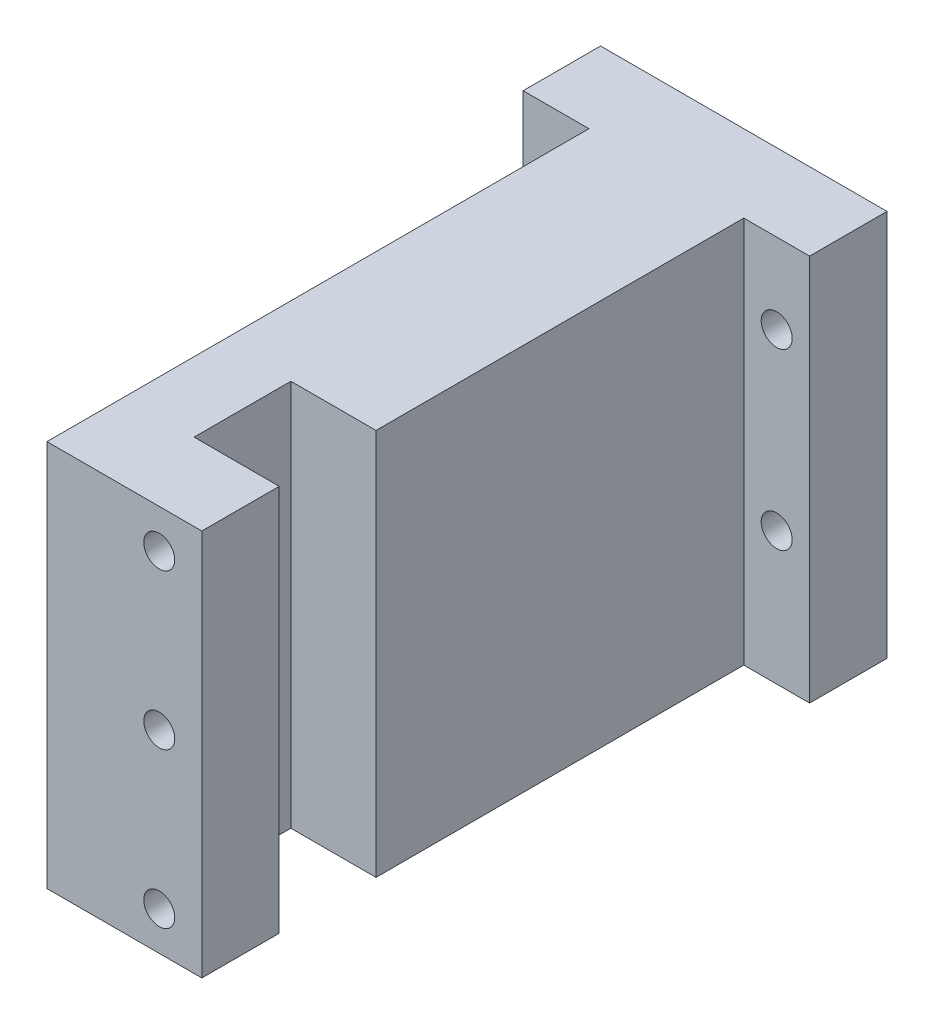
ISO-10303-21;
HEADER;
FILE_DESCRIPTION(('STEP AP214'),'2;1');
FILE_NAME('part.step','',(''),(''),'','','');
FILE_SCHEMA(('AUTOMOTIVE_DESIGN { 1 0 10303 214 1 1 1 1 }'));
ENDSEC;
DATA;
#1=APPLICATION_CONTEXT('core data for automotive mechanical design processes');
#2=APPLICATION_PROTOCOL_DEFINITION('international standard','automotive_design',2000,#1);
#3=PRODUCT_CONTEXT('',#1,'mechanical');
#4=PRODUCT('Part','Part','',(#3));
#5=PRODUCT_RELATED_PRODUCT_CATEGORY('part','',(#4));
#6=PRODUCT_DEFINITION_FORMATION('','',#4);
#7=PRODUCT_DEFINITION_CONTEXT('part definition',#1,'design');
#8=PRODUCT_DEFINITION('design','',#6,#7);
#9=PRODUCT_DEFINITION_SHAPE('','',#8);
#10=(LENGTH_UNIT() NAMED_UNIT(*) SI_UNIT(.MILLI.,.METRE.));
#11=(NAMED_UNIT(*) PLANE_ANGLE_UNIT() SI_UNIT($,.RADIAN.));
#12=(NAMED_UNIT(*) SI_UNIT($,.STERADIAN.) SOLID_ANGLE_UNIT());
#13=UNCERTAINTY_MEASURE_WITH_UNIT(LENGTH_MEASURE(1.E-05),#10,'distance_accuracy_value','');
#14=(GEOMETRIC_REPRESENTATION_CONTEXT(3) GLOBAL_UNCERTAINTY_ASSIGNED_CONTEXT((#13)) GLOBAL_UNIT_ASSIGNED_CONTEXT((#10,
#11,#12)) REPRESENTATION_CONTEXT('',''));
#15=CARTESIAN_POINT('',(0.,0.,0.));
#16=DIRECTION('',(0.,0.,1.));
#17=DIRECTION('',(1.,0.,0.));
#18=AXIS2_PLACEMENT_3D('',#15,#16,#17);
#19=CARTESIAN_POINT('',(20.,0.,160.));
#20=DIRECTION('',(-1.,0.,0.));
#21=DIRECTION('',(0.,-1.,0.));
#22=AXIS2_PLACEMENT_3D('',#19,#20,#21);
#23=PLANE('',#22);
#24=DIRECTION('',(0.,0.,-1.));
#25=VECTOR('',#24,1.);
#26=CARTESIAN_POINT('',(20.,50.,160.));
#27=LINE('',#26,#25);
#28=CARTESIAN_POINT('',(20.,50.,115.));
#29=VERTEX_POINT('',#28);
#30=CARTESIAN_POINT('',(20.,50.,20.));
#31=VERTEX_POINT('',#30);
#32=EDGE_CURVE('E206',#29,#31,#27,.T.);
#33=ORIENTED_EDGE('',*,*,#32,.F.);
#34=DIRECTION('',(0.,1.,0.));
#35=VECTOR('',#34,1.);
#36=CARTESIAN_POINT('',(20.,-50.,115.));
#37=LINE('',#36,#35);
#38=CARTESIAN_POINT('',(20.,-50.,115.));
#39=VERTEX_POINT('',#38);
#40=EDGE_CURVE('E160',#39,#29,#37,.T.);
#41=ORIENTED_EDGE('',*,*,#40,.F.);
#42=DIRECTION('',(0.,0.,-1.));
#43=VECTOR('',#42,1.);
#44=CARTESIAN_POINT('',(20.,-50.,160.));
#45=LINE('',#44,#43);
#46=CARTESIAN_POINT('',(20.,-50.,20.));
#47=VERTEX_POINT('',#46);
#48=EDGE_CURVE('E58',#39,#47,#45,.T.);
#49=ORIENTED_EDGE('',*,*,#48,.T.);
#50=DIRECTION('',(0.,1.,0.));
#51=VECTOR('',#50,1.);
#52=CARTESIAN_POINT('',(20.,0.,20.));
#53=LINE('',#52,#51);
#54=EDGE_CURVE('E184',#47,#31,#53,.T.);
#55=ORIENTED_EDGE('',*,*,#54,.T.);
#56=EDGE_LOOP('',(#33,#41,#49,#55));
#57=FACE_BOUND('',#56,.T.);
#58=ADVANCED_FACE('F35',(#57),#23,.F.);
#59=CARTESIAN_POINT('',(0.,0.,20.));
#60=DIRECTION('',(0.,0.,1.));
#61=DIRECTION('',(1.,0.,0.));
#62=AXIS2_PLACEMENT_3D('',#59,#60,#61);
#63=PLANE('',#62);
#64=CARTESIAN_POINT('',(-28.5,-15.7,20.));
#65=DIRECTION('',(0.,0.,1.));
#66=DIRECTION('',(1.,0.,0.));
#67=AXIS2_PLACEMENT_3D('',#64,#65,#66);
#68=CIRCLE('',#67,4.);
#69=CARTESIAN_POINT('',(-24.5,-15.7,20.));
#70=VERTEX_POINT('',#69);
#71=EDGE_CURVE('E173',#70,#70,#68,.T.);
#72=ORIENTED_EDGE('',*,*,#71,.F.);
#73=EDGE_LOOP('',(#72));
#74=FACE_BOUND('',#73,.T.);
#75=CARTESIAN_POINT('',(-28.5,29.3,20.));
#76=DIRECTION('',(0.,0.,1.));
#77=DIRECTION('',(1.,0.,0.));
#78=AXIS2_PLACEMENT_3D('',#75,#76,#77);
#79=CIRCLE('',#78,4.);
#80=CARTESIAN_POINT('',(-24.5,29.3,20.));
#81=VERTEX_POINT('',#80);
#82=EDGE_CURVE('E166',#81,#81,#79,.T.);
#83=ORIENTED_EDGE('',*,*,#82,.F.);
#84=EDGE_LOOP('',(#83));
#85=FACE_BOUND('',#84,.T.);
#86=DIRECTION('',(0.,-1.,0.));
#87=VECTOR('',#86,1.);
#88=CARTESIAN_POINT('',(-20.,0.,20.));
#89=LINE('',#88,#87);
#90=CARTESIAN_POINT('',(-20.,50.,20.));
#91=VERTEX_POINT('',#90);
#92=CARTESIAN_POINT('',(-20.,-50.,20.));
#93=VERTEX_POINT('',#92);
#94=EDGE_CURVE('E191',#91,#93,#89,.T.);
#95=ORIENTED_EDGE('',*,*,#94,.F.);
#96=DIRECTION('',(-1.,0.,0.));
#97=VECTOR('',#96,1.);
#98=CARTESIAN_POINT('',(-37.,50.,20.));
#99=LINE('',#98,#97);
#100=CARTESIAN_POINT('',(-37.,50.,20.));
#101=VERTEX_POINT('',#100);
#102=EDGE_CURVE('E216',#91,#101,#99,.T.);
#103=ORIENTED_EDGE('',*,*,#102,.T.);
#104=DIRECTION('',(0.,-1.,0.));
#105=VECTOR('',#104,1.);
#106=CARTESIAN_POINT('',(-37.,50.,20.));
#107=LINE('',#106,#105);
#108=CARTESIAN_POINT('',(-37.,-50.,20.));
#109=VERTEX_POINT('',#108);
#110=EDGE_CURVE('E221',#101,#109,#107,.T.);
#111=ORIENTED_EDGE('',*,*,#110,.T.);
#112=DIRECTION('',(1.,0.,0.));
#113=VECTOR('',#112,1.);
#114=CARTESIAN_POINT('',(-37.,-50.,20.));
#115=LINE('',#114,#113);
#116=EDGE_CURVE('E224',#109,#93,#115,.T.);
#117=ORIENTED_EDGE('',*,*,#116,.T.);
#118=EDGE_LOOP('',(#95,#103,#111,#117));
#119=FACE_BOUND('',#118,.T.);
#120=ADVANCED_FACE('F276',(#74,#85,#119),#63,.T.);
#121=CARTESIAN_POINT('',(37.,50.,20.));
#122=DIRECTION('',(-1.,0.,0.));
#123=DIRECTION('',(0.,-1.,0.));
#124=AXIS2_PLACEMENT_3D('',#121,#122,#123);
#125=PLANE('',#124);
#126=DIRECTION('',(0.,1.,0.));
#127=VECTOR('',#126,1.);
#128=CARTESIAN_POINT('',(37.,50.,0.));
#129=LINE('',#128,#127);
#130=CARTESIAN_POINT('',(37.,-50.,0.));
#131=VERTEX_POINT('',#130);
#132=CARTESIAN_POINT('',(37.,50.,0.));
#133=VERTEX_POINT('',#132);
#134=EDGE_CURVE('E212',#131,#133,#129,.T.);
#135=ORIENTED_EDGE('',*,*,#134,.T.);
#136=DIRECTION('',(0.,0.,-1.));
#137=VECTOR('',#136,1.);
#138=CARTESIAN_POINT('',(37.,50.,20.));
#139=LINE('',#138,#137);
#140=CARTESIAN_POINT('',(37.,50.,20.));
#141=VERTEX_POINT('',#140);
#142=EDGE_CURVE('E11',#141,#133,#139,.T.);
#143=ORIENTED_EDGE('',*,*,#142,.F.);
#144=DIRECTION('',(0.,1.,0.));
#145=VECTOR('',#144,1.);
#146=CARTESIAN_POINT('',(37.,50.,20.));
#147=LINE('',#146,#145);
#148=CARTESIAN_POINT('',(37.,-50.,20.));
#149=VERTEX_POINT('',#148);
#150=EDGE_CURVE('E213',#149,#141,#147,.T.);
#151=ORIENTED_EDGE('',*,*,#150,.F.);
#152=DIRECTION('',(0.,0.,-1.));
#153=VECTOR('',#152,1.);
#154=CARTESIAN_POINT('',(37.,-50.,20.));
#155=LINE('',#154,#153);
#156=EDGE_CURVE('E226',#149,#131,#155,.T.);
#157=ORIENTED_EDGE('',*,*,#156,.T.);
#158=EDGE_LOOP('',(#135,#143,#151,#157));
#159=FACE_BOUND('',#158,.T.);
#160=ADVANCED_FACE('F37',(#159),#125,.F.);
#161=CARTESIAN_POINT('',(-37.,50.,20.));
#162=DIRECTION('',(0.,-1.,0.));
#163=DIRECTION('',(0.,0.,-1.));
#164=AXIS2_PLACEMENT_3D('',#161,#162,#163);
#165=PLANE('',#164);
#166=DIRECTION('',(0.,0.,1.));
#167=VECTOR('',#166,1.);
#168=CARTESIAN_POINT('',(-1.99999999999998,50.,140.));
#169=LINE('',#168,#167);
#170=CARTESIAN_POINT('',(-1.99999999999998,50.,115.));
#171=VERTEX_POINT('',#170);
#172=CARTESIAN_POINT('',(-1.99999999999998,50.,140.));
#173=VERTEX_POINT('',#172);
#174=EDGE_CURVE('E133',#171,#173,#169,.T.);
#175=ORIENTED_EDGE('',*,*,#174,.F.);
#176=DIRECTION('',(-1.,0.,0.));
#177=VECTOR('',#176,1.);
#178=CARTESIAN_POINT('',(-1.99999999999998,50.,115.));
#179=LINE('',#178,#177);
#180=EDGE_CURVE('E145',#29,#171,#179,.T.);
#181=ORIENTED_EDGE('',*,*,#180,.F.);
#182=ORIENTED_EDGE('',*,*,#32,.T.);
#183=EDGE_CURVE('E218',#141,#31,#99,.T.);
#184=ORIENTED_EDGE('',*,*,#183,.F.);
#185=ORIENTED_EDGE('',*,*,#142,.T.);
#186=DIRECTION('',(-1.,0.,0.));
#187=VECTOR('',#186,1.);
#188=CARTESIAN_POINT('',(-37.,50.,0.));
#189=LINE('',#188,#187);
#190=CARTESIAN_POINT('',(-37.,50.,0.));
#191=VERTEX_POINT('',#190);
#192=EDGE_CURVE('E229',#133,#191,#189,.T.);
#193=ORIENTED_EDGE('',*,*,#192,.T.);
#194=DIRECTION('',(0.,0.,-1.));
#195=VECTOR('',#194,1.);
#196=CARTESIAN_POINT('',(-37.,50.,20.));
#197=LINE('',#196,#195);
#198=EDGE_CURVE('E43',#101,#191,#197,.T.);
#199=ORIENTED_EDGE('',*,*,#198,.F.);
#200=ORIENTED_EDGE('',*,*,#102,.F.);
#201=DIRECTION('',(0.,0.,-1.));
#202=VECTOR('',#201,1.);
#203=CARTESIAN_POINT('',(-20.,50.,160.));
#204=LINE('',#203,#202);
#205=CARTESIAN_POINT('',(-20.,50.,160.));
#206=VERTEX_POINT('',#205);
#207=EDGE_CURVE('E203',#206,#91,#204,.T.);
#208=ORIENTED_EDGE('',*,*,#207,.F.);
#209=DIRECTION('',(-1.,0.,0.));
#210=VECTOR('',#209,1.);
#211=CARTESIAN_POINT('',(0.,50.,160.));
#212=LINE('',#211,#210);
#213=CARTESIAN_POINT('',(20.,50.,160.));
#214=VERTEX_POINT('',#213);
#215=EDGE_CURVE('E193',#214,#206,#212,.T.);
#216=ORIENTED_EDGE('',*,*,#215,.F.);
#217=CARTESIAN_POINT('',(20.,50.,140.));
#218=VERTEX_POINT('',#217);
#219=EDGE_CURVE('E207',#214,#218,#27,.T.);
#220=ORIENTED_EDGE('',*,*,#219,.T.);
#221=DIRECTION('',(1.,0.,0.));
#222=VECTOR('',#221,1.);
#223=CARTESIAN_POINT('',(-1.99999999999998,50.,140.));
#224=LINE('',#223,#222);
#225=EDGE_CURVE('E50',#173,#218,#224,.T.);
#226=ORIENTED_EDGE('',*,*,#225,.F.);
#227=EDGE_LOOP('',(#175,#181,#182,#184,#185,#193,#199,#200,#208,#216,#220,#226));
#228=FACE_BOUND('',#227,.T.);
#229=ADVANCED_FACE('F261',(#228),#165,.F.);
#230=CARTESIAN_POINT('',(-37.,50.,20.));
#231=DIRECTION('',(1.,0.,0.));
#232=DIRECTION('',(0.,1.,0.));
#233=AXIS2_PLACEMENT_3D('',#230,#231,#232);
#234=PLANE('',#233);
#235=DIRECTION('',(0.,-1.,0.));
#236=VECTOR('',#235,1.);
#237=CARTESIAN_POINT('',(-37.,50.,0.));
#238=LINE('',#237,#236);
#239=CARTESIAN_POINT('',(-37.,-50.,0.));
#240=VERTEX_POINT('',#239);
#241=EDGE_CURVE('E231',#191,#240,#238,.T.);
#242=ORIENTED_EDGE('',*,*,#241,.T.);
#243=DIRECTION('',(0.,0.,-1.));
#244=VECTOR('',#243,1.);
#245=CARTESIAN_POINT('',(-37.,-50.,20.));
#246=LINE('',#245,#244);
#247=EDGE_CURVE('E236',#109,#240,#246,.T.);
#248=ORIENTED_EDGE('',*,*,#247,.F.);
#249=ORIENTED_EDGE('',*,*,#110,.F.);
#250=ORIENTED_EDGE('',*,*,#198,.T.);
#251=EDGE_LOOP('',(#242,#248,#249,#250));
#252=FACE_BOUND('',#251,.T.);
#253=ADVANCED_FACE('F243',(#252),#234,.F.);
#254=CARTESIAN_POINT('',(-37.,-50.,20.));
#255=DIRECTION('',(0.,1.,0.));
#256=DIRECTION('',(-1.,0.,0.));
#257=AXIS2_PLACEMENT_3D('',#254,#255,#256);
#258=PLANE('',#257);
#259=ORIENTED_EDGE('',*,*,#48,.F.);
#260=DIRECTION('',(-1.,0.,0.));
#261=VECTOR('',#260,1.);
#262=CARTESIAN_POINT('',(-1.99999999999998,-50.,115.));
#263=LINE('',#262,#261);
#264=CARTESIAN_POINT('',(-1.99999999999998,-50.,115.));
#265=VERTEX_POINT('',#264);
#266=EDGE_CURVE('E135',#39,#265,#263,.T.);
#267=ORIENTED_EDGE('',*,*,#266,.T.);
#268=DIRECTION('',(0.,0.,1.));
#269=VECTOR('',#268,1.);
#270=CARTESIAN_POINT('',(-1.99999999999998,-50.,140.));
#271=LINE('',#270,#269);
#272=CARTESIAN_POINT('',(-1.99999999999998,-50.,140.));
#273=VERTEX_POINT('',#272);
#274=EDGE_CURVE('E130',#265,#273,#271,.T.);
#275=ORIENTED_EDGE('',*,*,#274,.T.);
#276=DIRECTION('',(1.,0.,0.));
#277=VECTOR('',#276,1.);
#278=CARTESIAN_POINT('',(-1.99999999999998,-50.,140.));
#279=LINE('',#278,#277);
#280=CARTESIAN_POINT('',(20.,-50.,140.));
#281=VERTEX_POINT('',#280);
#282=EDGE_CURVE('E138',#273,#281,#279,.T.);
#283=ORIENTED_EDGE('',*,*,#282,.T.);
#284=CARTESIAN_POINT('',(20.,-50.,160.));
#285=VERTEX_POINT('',#284);
#286=EDGE_CURVE('E210',#285,#281,#45,.T.);
#287=ORIENTED_EDGE('',*,*,#286,.F.);
#288=DIRECTION('',(1.,0.,0.));
#289=VECTOR('',#288,1.);
#290=CARTESIAN_POINT('',(0.,-50.,160.));
#291=LINE('',#290,#289);
#292=CARTESIAN_POINT('',(-20.,-50.,160.));
#293=VERTEX_POINT('',#292);
#294=EDGE_CURVE('E187',#293,#285,#291,.T.);
#295=ORIENTED_EDGE('',*,*,#294,.F.);
#296=DIRECTION('',(0.,0.,-1.));
#297=VECTOR('',#296,1.);
#298=CARTESIAN_POINT('',(-20.,-50.,160.));
#299=LINE('',#298,#297);
#300=EDGE_CURVE('E197',#293,#93,#299,.T.);
#301=ORIENTED_EDGE('',*,*,#300,.T.);
#302=ORIENTED_EDGE('',*,*,#116,.F.);
#303=ORIENTED_EDGE('',*,*,#247,.T.);
#304=DIRECTION('',(1.,0.,0.));
#305=VECTOR('',#304,1.);
#306=CARTESIAN_POINT('',(-37.,-50.,0.));
#307=LINE('',#306,#305);
#308=EDGE_CURVE('E217',#240,#131,#307,.T.);
#309=ORIENTED_EDGE('',*,*,#308,.T.);
#310=ORIENTED_EDGE('',*,*,#156,.F.);
#311=EDGE_CURVE('E223',#47,#149,#115,.T.);
#312=ORIENTED_EDGE('',*,*,#311,.F.);
#313=EDGE_LOOP('',(#259,#267,#275,#283,#287,#295,#301,#302,#303,#309,#310,#312));
#314=FACE_BOUND('',#313,.T.);
#315=ADVANCED_FACE('F144',(#314),#258,.F.);
#316=CARTESIAN_POINT('',(28.5,29.3,20.));
#317=DIRECTION('',(0.,0.,1.));
#318=DIRECTION('',(1.,0.,0.));
#319=AXIS2_PLACEMENT_3D('',#316,#317,#318);
#320=CIRCLE('',#319,4.);
#321=CARTESIAN_POINT('',(32.5,29.3,20.));
#322=VERTEX_POINT('',#321);
#323=EDGE_CURVE('E167',#322,#322,#320,.T.);
#324=ORIENTED_EDGE('',*,*,#323,.F.);
#325=EDGE_LOOP('',(#324));
#326=FACE_BOUND('',#325,.T.);
#327=CARTESIAN_POINT('',(28.5,-15.7,20.));
#328=DIRECTION('',(0.,0.,1.));
#329=DIRECTION('',(1.,0.,0.));
#330=AXIS2_PLACEMENT_3D('',#327,#328,#329);
#331=CIRCLE('',#330,4.);
#332=CARTESIAN_POINT('',(32.5,-15.7,20.));
#333=VERTEX_POINT('',#332);
#334=EDGE_CURVE('E159',#333,#333,#331,.T.);
#335=ORIENTED_EDGE('',*,*,#334,.F.);
#336=EDGE_LOOP('',(#335));
#337=FACE_BOUND('',#336,.T.);
#338=ORIENTED_EDGE('',*,*,#54,.F.);
#339=ORIENTED_EDGE('',*,*,#311,.T.);
#340=ORIENTED_EDGE('',*,*,#150,.T.);
#341=ORIENTED_EDGE('',*,*,#183,.T.);
#342=EDGE_LOOP('',(#338,#339,#340,#341));
#343=FACE_BOUND('',#342,.T.);
#344=ADVANCED_FACE('F258',(#326,#337,#343),#63,.T.);
#345=CARTESIAN_POINT('',(0.,0.,0.));
#346=DIRECTION('',(0.,0.,1.));
#347=DIRECTION('',(1.,0.,0.));
#348=AXIS2_PLACEMENT_3D('',#345,#346,#347);
#349=PLANE('',#348);
#350=CARTESIAN_POINT('',(28.5,29.3,0.));
#351=DIRECTION('',(0.,0.,1.));
#352=DIRECTION('',(1.,0.,0.));
#353=AXIS2_PLACEMENT_3D('',#350,#351,#352);
#354=CIRCLE('',#353,4.);
#355=CARTESIAN_POINT('',(32.5,29.3,0.));
#356=VERTEX_POINT('',#355);
#357=EDGE_CURVE('E163',#356,#356,#354,.T.);
#358=ORIENTED_EDGE('',*,*,#357,.T.);
#359=EDGE_LOOP('',(#358));
#360=FACE_BOUND('',#359,.T.);
#361=CARTESIAN_POINT('',(-28.5,-15.7,0.));
#362=DIRECTION('',(0.,0.,1.));
#363=DIRECTION('',(1.,0.,0.));
#364=AXIS2_PLACEMENT_3D('',#361,#362,#363);
#365=CIRCLE('',#364,4.);
#366=CARTESIAN_POINT('',(-24.5,-15.7,0.));
#367=VERTEX_POINT('',#366);
#368=EDGE_CURVE('E170',#367,#367,#365,.T.);
#369=ORIENTED_EDGE('',*,*,#368,.T.);
#370=EDGE_LOOP('',(#369));
#371=FACE_BOUND('',#370,.T.);
#372=CARTESIAN_POINT('',(28.5,-15.7,0.));
#373=DIRECTION('',(0.,0.,1.));
#374=DIRECTION('',(1.,0.,0.));
#375=AXIS2_PLACEMENT_3D('',#372,#373,#374);
#376=CIRCLE('',#375,4.);
#377=CARTESIAN_POINT('',(32.5,-15.7,0.));
#378=VERTEX_POINT('',#377);
#379=EDGE_CURVE('E176',#378,#378,#376,.T.);
#380=ORIENTED_EDGE('',*,*,#379,.T.);
#381=EDGE_LOOP('',(#380));
#382=FACE_BOUND('',#381,.T.);
#383=CARTESIAN_POINT('',(-28.5,29.3,0.));
#384=DIRECTION('',(0.,0.,1.));
#385=DIRECTION('',(1.,0.,0.));
#386=AXIS2_PLACEMENT_3D('',#383,#384,#385);
#387=CIRCLE('',#386,4.);
#388=CARTESIAN_POINT('',(-24.5,29.3,0.));
#389=VERTEX_POINT('',#388);
#390=EDGE_CURVE('E181',#389,#389,#387,.T.);
#391=ORIENTED_EDGE('',*,*,#390,.T.);
#392=EDGE_LOOP('',(#391));
#393=FACE_BOUND('',#392,.T.);
#394=ORIENTED_EDGE('',*,*,#134,.F.);
#395=ORIENTED_EDGE('',*,*,#308,.F.);
#396=ORIENTED_EDGE('',*,*,#241,.F.);
#397=ORIENTED_EDGE('',*,*,#192,.F.);
#398=EDGE_LOOP('',(#394,#395,#396,#397));
#399=FACE_BOUND('',#398,.T.);
#400=ADVANCED_FACE('F250',(#360,#371,#382,#393,#399),#349,.F.);
#401=ORIENTED_EDGE('',*,*,#286,.T.);
#402=DIRECTION('',(0.,1.,0.));
#403=VECTOR('',#402,1.);
#404=CARTESIAN_POINT('',(20.,-50.,140.));
#405=LINE('',#404,#403);
#406=EDGE_CURVE('E134',#281,#218,#405,.T.);
#407=ORIENTED_EDGE('',*,*,#406,.T.);
#408=ORIENTED_EDGE('',*,*,#219,.F.);
#409=DIRECTION('',(0.,1.,0.));
#410=VECTOR('',#409,1.);
#411=CARTESIAN_POINT('',(20.,0.,160.));
#412=LINE('',#411,#410);
#413=EDGE_CURVE('E190',#285,#214,#412,.T.);
#414=ORIENTED_EDGE('',*,*,#413,.F.);
#415=EDGE_LOOP('',(#401,#407,#408,#414));
#416=FACE_BOUND('',#415,.T.);
#417=ADVANCED_FACE('F278',(#416),#23,.F.);
#418=CARTESIAN_POINT('',(-20.,0.,160.));
#419=DIRECTION('',(1.,0.,0.));
#420=DIRECTION('',(0.,0.,-1.));
#421=AXIS2_PLACEMENT_3D('',#418,#419,#420);
#422=PLANE('',#421);
#423=ORIENTED_EDGE('',*,*,#94,.T.);
#424=ORIENTED_EDGE('',*,*,#300,.F.);
#425=DIRECTION('',(0.,-1.,0.));
#426=VECTOR('',#425,1.);
#427=CARTESIAN_POINT('',(-20.,0.,160.));
#428=LINE('',#427,#426);
#429=EDGE_CURVE('E195',#206,#293,#428,.T.);
#430=ORIENTED_EDGE('',*,*,#429,.F.);
#431=ORIENTED_EDGE('',*,*,#207,.T.);
#432=EDGE_LOOP('',(#423,#424,#430,#431));
#433=FACE_BOUND('',#432,.T.);
#434=ADVANCED_FACE('F286',(#433),#422,.F.);
#435=CARTESIAN_POINT('',(0.,0.,160.));
#436=DIRECTION('',(0.,0.,1.));
#437=DIRECTION('',(1.,0.,0.));
#438=AXIS2_PLACEMENT_3D('',#435,#436,#437);
#439=PLANE('',#438);
#440=CARTESIAN_POINT('',(9.00000000000002,40.,160.));
#441=DIRECTION('',(0.,0.,1.));
#442=DIRECTION('',(1.,0.,0.));
#443=AXIS2_PLACEMENT_3D('',#440,#441,#442);
#444=CIRCLE('',#443,4.);
#445=CARTESIAN_POINT('',(13.,40.,160.));
#446=VERTEX_POINT('',#445);
#447=EDGE_CURVE('E492',#446,#446,#444,.T.);
#448=ORIENTED_EDGE('',*,*,#447,.F.);
#449=EDGE_LOOP('',(#448));
#450=FACE_BOUND('',#449,.T.);
#451=CARTESIAN_POINT('',(9.00000000000002,0.,160.));
#452=DIRECTION('',(0.,0.,1.));
#453=DIRECTION('',(1.,0.,0.));
#454=AXIS2_PLACEMENT_3D('',#451,#452,#453);
#455=CIRCLE('',#454,4.00000000000001);
#456=CARTESIAN_POINT('',(13.,0.,160.));
#457=VERTEX_POINT('',#456);
#458=EDGE_CURVE('E500',#457,#457,#455,.T.);
#459=ORIENTED_EDGE('',*,*,#458,.F.);
#460=EDGE_LOOP('',(#459));
#461=FACE_BOUND('',#460,.T.);
#462=CARTESIAN_POINT('',(9.00000000000002,-40.,160.));
#463=DIRECTION('',(0.,0.,1.));
#464=DIRECTION('',(1.,0.,0.));
#465=AXIS2_PLACEMENT_3D('',#462,#463,#464);
#466=CIRCLE('',#465,4.);
#467=CARTESIAN_POINT('',(13.,-40.,160.));
#468=VERTEX_POINT('',#467);
#469=EDGE_CURVE('E150',#468,#468,#466,.T.);
#470=ORIENTED_EDGE('',*,*,#469,.F.);
#471=EDGE_LOOP('',(#470));
#472=FACE_BOUND('',#471,.T.);
#473=ORIENTED_EDGE('',*,*,#294,.T.);
#474=ORIENTED_EDGE('',*,*,#413,.T.);
#475=ORIENTED_EDGE('',*,*,#215,.T.);
#476=ORIENTED_EDGE('',*,*,#429,.T.);
#477=EDGE_LOOP('',(#473,#474,#475,#476));
#478=FACE_BOUND('',#477,.T.);
#479=ADVANCED_FACE('F292',(#450,#461,#472,#478),#439,.T.);
#480=CARTESIAN_POINT('',(-28.5,29.3,0.));
#481=DIRECTION('',(0.,0.,1.));
#482=DIRECTION('',(1.,0.,0.));
#483=AXIS2_PLACEMENT_3D('',#480,#481,#482);
#484=CYLINDRICAL_SURFACE('',#483,4.);
#485=ORIENTED_EDGE('',*,*,#390,.F.);
#486=EDGE_LOOP('',(#485));
#487=FACE_BOUND('',#486,.T.);
#488=ORIENTED_EDGE('',*,*,#82,.T.);
#489=EDGE_LOOP('',(#488));
#490=FACE_BOUND('',#489,.T.);
#491=ADVANCED_FACE('F305',(#487,#490),#484,.F.);
#492=CARTESIAN_POINT('',(28.5,-15.7,0.));
#493=DIRECTION('',(0.,0.,1.));
#494=DIRECTION('',(1.,0.,0.));
#495=AXIS2_PLACEMENT_3D('',#492,#493,#494);
#496=CYLINDRICAL_SURFACE('',#495,4.);
#497=ORIENTED_EDGE('',*,*,#379,.F.);
#498=EDGE_LOOP('',(#497));
#499=FACE_BOUND('',#498,.T.);
#500=ORIENTED_EDGE('',*,*,#334,.T.);
#501=EDGE_LOOP('',(#500));
#502=FACE_BOUND('',#501,.T.);
#503=ADVANCED_FACE('F311',(#499,#502),#496,.F.);
#504=CARTESIAN_POINT('',(-28.5,-15.7,0.));
#505=DIRECTION('',(0.,0.,1.));
#506=DIRECTION('',(1.,0.,0.));
#507=AXIS2_PLACEMENT_3D('',#504,#505,#506);
#508=CYLINDRICAL_SURFACE('',#507,4.);
#509=ORIENTED_EDGE('',*,*,#368,.F.);
#510=EDGE_LOOP('',(#509));
#511=FACE_BOUND('',#510,.T.);
#512=ORIENTED_EDGE('',*,*,#71,.T.);
#513=EDGE_LOOP('',(#512));
#514=FACE_BOUND('',#513,.T.);
#515=ADVANCED_FACE('F319',(#511,#514),#508,.F.);
#516=CARTESIAN_POINT('',(28.5,29.3,0.));
#517=DIRECTION('',(0.,0.,1.));
#518=DIRECTION('',(1.,0.,0.));
#519=AXIS2_PLACEMENT_3D('',#516,#517,#518);
#520=CYLINDRICAL_SURFACE('',#519,4.);
#521=ORIENTED_EDGE('',*,*,#357,.F.);
#522=EDGE_LOOP('',(#521));
#523=FACE_BOUND('',#522,.T.);
#524=ORIENTED_EDGE('',*,*,#323,.T.);
#525=EDGE_LOOP('',(#524));
#526=FACE_BOUND('',#525,.T.);
#527=ADVANCED_FACE('F272',(#523,#526),#520,.F.);
#528=CARTESIAN_POINT('',(-1.99999999999998,-50.,140.));
#529=DIRECTION('',(-1.,0.,0.));
#530=DIRECTION('',(0.,0.,1.));
#531=AXIS2_PLACEMENT_3D('',#528,#529,#530);
#532=PLANE('',#531);
#533=ORIENTED_EDGE('',*,*,#174,.T.);
#534=DIRECTION('',(0.,1.,0.));
#535=VECTOR('',#534,1.);
#536=CARTESIAN_POINT('',(-1.99999999999998,-50.,140.));
#537=LINE('',#536,#535);
#538=EDGE_CURVE('E126',#273,#173,#537,.T.);
#539=ORIENTED_EDGE('',*,*,#538,.F.);
#540=ORIENTED_EDGE('',*,*,#274,.F.);
#541=DIRECTION('',(0.,1.,0.));
#542=VECTOR('',#541,1.);
#543=CARTESIAN_POINT('',(-1.99999999999998,-50.,115.));
#544=LINE('',#543,#542);
#545=EDGE_CURVE('E157',#265,#171,#544,.T.);
#546=ORIENTED_EDGE('',*,*,#545,.T.);
#547=EDGE_LOOP('',(#533,#539,#540,#546));
#548=FACE_BOUND('',#547,.T.);
#549=ADVANCED_FACE('F128',(#548),#532,.F.);
#550=CARTESIAN_POINT('',(-1.99999999999998,-50.,115.));
#551=DIRECTION('',(0.,0.,-1.));
#552=DIRECTION('',(-1.,0.,0.));
#553=AXIS2_PLACEMENT_3D('',#550,#551,#552);
#554=PLANE('',#553);
#555=ORIENTED_EDGE('',*,*,#180,.T.);
#556=ORIENTED_EDGE('',*,*,#545,.F.);
#557=ORIENTED_EDGE('',*,*,#266,.F.);
#558=ORIENTED_EDGE('',*,*,#40,.T.);
#559=EDGE_LOOP('',(#555,#556,#557,#558));
#560=FACE_BOUND('',#559,.T.);
#561=ADVANCED_FACE('F263',(#560),#554,.F.);
#562=CARTESIAN_POINT('',(-1.99999999999998,-50.,140.));
#563=DIRECTION('',(0.,0.,1.));
#564=DIRECTION('',(1.,0.,0.));
#565=AXIS2_PLACEMENT_3D('',#562,#563,#564);
#566=PLANE('',#565);
#567=ORIENTED_EDGE('',*,*,#225,.T.);
#568=ORIENTED_EDGE('',*,*,#406,.F.);
#569=ORIENTED_EDGE('',*,*,#282,.F.);
#570=ORIENTED_EDGE('',*,*,#538,.T.);
#571=EDGE_LOOP('',(#567,#568,#569,#570));
#572=FACE_BOUND('',#571,.T.);
#573=ADVANCED_FACE('F139',(#572),#566,.F.);
#574=CARTESIAN_POINT('',(9.00000000000002,-40.,150.));
#575=DIRECTION('',(0.,0.,1.));
#576=DIRECTION('',(1.,0.,0.));
#577=AXIS2_PLACEMENT_3D('',#574,#575,#576);
#578=CYLINDRICAL_SURFACE('',#577,4.);
#579=CARTESIAN_POINT('',(9.00000000000002,-40.,150.));
#580=DIRECTION('',(0.,0.,1.));
#581=DIRECTION('',(1.,0.,0.));
#582=AXIS2_PLACEMENT_3D('',#579,#580,#581);
#583=CIRCLE('',#582,4.);
#584=CARTESIAN_POINT('',(13.,-40.,150.));
#585=VERTEX_POINT('',#584);
#586=EDGE_CURVE('E502',#585,#585,#583,.T.);
#587=ORIENTED_EDGE('',*,*,#586,.F.);
#588=EDGE_LOOP('',(#587));
#589=FACE_BOUND('',#588,.T.);
#590=ORIENTED_EDGE('',*,*,#469,.T.);
#591=EDGE_LOOP('',(#590));
#592=FACE_BOUND('',#591,.T.);
#593=ADVANCED_FACE('F270',(#589,#592),#578,.F.);
#594=CARTESIAN_POINT('',(9.00000000000002,-40.,150.));
#595=DIRECTION('',(0.,0.,1.));
#596=DIRECTION('',(1.,0.,0.));
#597=AXIS2_PLACEMENT_3D('',#594,#595,#596);
#598=PLANE('',#597);
#599=ORIENTED_EDGE('',*,*,#586,.T.);
#600=EDGE_LOOP('',(#599));
#601=FACE_BOUND('',#600,.T.);
#602=ADVANCED_FACE('F437',(#601),#598,.T.);
#603=CARTESIAN_POINT('',(9.00000000000002,0.,150.));
#604=DIRECTION('',(0.,0.,1.));
#605=DIRECTION('',(1.,0.,0.));
#606=AXIS2_PLACEMENT_3D('',#603,#604,#605);
#607=CYLINDRICAL_SURFACE('',#606,4.00000000000001);
#608=CARTESIAN_POINT('',(9.00000000000002,0.,150.));
#609=DIRECTION('',(0.,0.,1.));
#610=DIRECTION('',(1.,0.,0.));
#611=AXIS2_PLACEMENT_3D('',#608,#609,#610);
#612=CIRCLE('',#611,4.00000000000001);
#613=CARTESIAN_POINT('',(13.,0.,150.));
#614=VERTEX_POINT('',#613);
#615=EDGE_CURVE('E495',#614,#614,#612,.T.);
#616=ORIENTED_EDGE('',*,*,#615,.F.);
#617=EDGE_LOOP('',(#616));
#618=FACE_BOUND('',#617,.T.);
#619=ORIENTED_EDGE('',*,*,#458,.T.);
#620=EDGE_LOOP('',(#619));
#621=FACE_BOUND('',#620,.T.);
#622=ADVANCED_FACE('F446',(#618,#621),#607,.F.);
#623=CARTESIAN_POINT('',(9.00000000000002,0.,150.));
#624=DIRECTION('',(0.,0.,1.));
#625=DIRECTION('',(1.,0.,0.));
#626=AXIS2_PLACEMENT_3D('',#623,#624,#625);
#627=PLANE('',#626);
#628=ORIENTED_EDGE('',*,*,#615,.T.);
#629=EDGE_LOOP('',(#628));
#630=FACE_BOUND('',#629,.T.);
#631=ADVANCED_FACE('F456',(#630),#627,.T.);
#632=CARTESIAN_POINT('',(9.00000000000002,40.,150.));
#633=DIRECTION('',(0.,0.,1.));
#634=DIRECTION('',(1.,0.,0.));
#635=AXIS2_PLACEMENT_3D('',#632,#633,#634);
#636=CYLINDRICAL_SURFACE('',#635,4.);
#637=CARTESIAN_POINT('',(9.00000000000002,40.,150.));
#638=DIRECTION('',(0.,0.,1.));
#639=DIRECTION('',(1.,0.,0.));
#640=AXIS2_PLACEMENT_3D('',#637,#638,#639);
#641=CIRCLE('',#640,4.);
#642=CARTESIAN_POINT('',(13.,40.,150.));
#643=VERTEX_POINT('',#642);
#644=EDGE_CURVE('E155',#643,#643,#641,.T.);
#645=ORIENTED_EDGE('',*,*,#644,.F.);
#646=EDGE_LOOP('',(#645));
#647=FACE_BOUND('',#646,.T.);
#648=ORIENTED_EDGE('',*,*,#447,.T.);
#649=EDGE_LOOP('',(#648));
#650=FACE_BOUND('',#649,.T.);
#651=ADVANCED_FACE('F466',(#647,#650),#636,.F.);
#652=CARTESIAN_POINT('',(9.00000000000002,40.,150.));
#653=DIRECTION('',(0.,0.,1.));
#654=DIRECTION('',(1.,0.,0.));
#655=AXIS2_PLACEMENT_3D('',#652,#653,#654);
#656=PLANE('',#655);
#657=ORIENTED_EDGE('',*,*,#644,.T.);
#658=EDGE_LOOP('',(#657));
#659=FACE_BOUND('',#658,.T.);
#660=ADVANCED_FACE('F476',(#659),#656,.T.);
#661=CLOSED_SHELL('',(#58,#120,#160,#229,#253,#315,#344,#400,#417,#434,#479,#491,#503,#515,#527,
#549,#561,#573,#593,#602,#622,#631,#651,#660));
#662=MANIFOLD_SOLID_BREP('B2',#661);
#663=ADVANCED_BREP_SHAPE_REPRESENTATION('',(#18,#662),#14);
#664=SHAPE_DEFINITION_REPRESENTATION(#9,#663);
ENDSEC;
END-ISO-10303-21;
